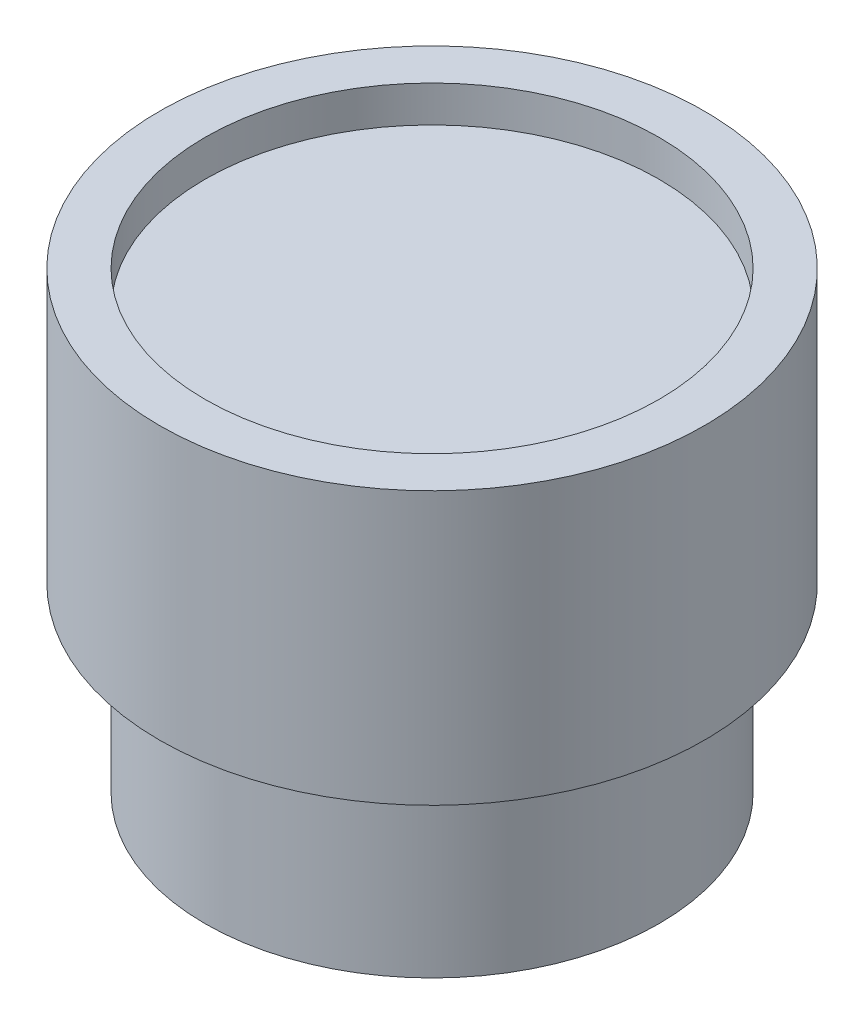
ISO-10303-21;
HEADER;
FILE_DESCRIPTION(('STEP AP214'),'2;1');
FILE_NAME('part.step','',(''),(''),'','','');
FILE_SCHEMA(('AUTOMOTIVE_DESIGN { 1 0 10303 214 1 1 1 1 }'));
ENDSEC;
DATA;
#1=APPLICATION_CONTEXT('core data for automotive mechanical design processes');
#2=APPLICATION_PROTOCOL_DEFINITION('international standard','automotive_design',2000,#1);
#3=PRODUCT_CONTEXT('',#1,'mechanical');
#4=PRODUCT('Part','Part','',(#3));
#5=PRODUCT_RELATED_PRODUCT_CATEGORY('part','',(#4));
#6=PRODUCT_DEFINITION_FORMATION('','',#4);
#7=PRODUCT_DEFINITION_CONTEXT('part definition',#1,'design');
#8=PRODUCT_DEFINITION('design','',#6,#7);
#9=PRODUCT_DEFINITION_SHAPE('','',#8);
#10=(LENGTH_UNIT() NAMED_UNIT(*) SI_UNIT(.MILLI.,.METRE.));
#11=(NAMED_UNIT(*) PLANE_ANGLE_UNIT() SI_UNIT($,.RADIAN.));
#12=(NAMED_UNIT(*) SI_UNIT($,.STERADIAN.) SOLID_ANGLE_UNIT());
#13=UNCERTAINTY_MEASURE_WITH_UNIT(LENGTH_MEASURE(1.E-05),#10,'distance_accuracy_value','');
#14=(GEOMETRIC_REPRESENTATION_CONTEXT(3) GLOBAL_UNCERTAINTY_ASSIGNED_CONTEXT((#13)) GLOBAL_UNIT_ASSIGNED_CONTEXT((#10,
#11,#12)) REPRESENTATION_CONTEXT('',''));
#15=CARTESIAN_POINT('',(0.,0.,0.));
#16=DIRECTION('',(0.,0.,1.));
#17=DIRECTION('',(1.,0.,0.));
#18=AXIS2_PLACEMENT_3D('',#15,#16,#17);
#19=CARTESIAN_POINT('',(0.,10.,0.));
#20=DIRECTION('',(0.,-1.,0.));
#21=DIRECTION('',(0.,0.,-1.));
#22=AXIS2_PLACEMENT_3D('',#19,#20,#21);
#23=CYLINDRICAL_SURFACE('',#22,12.5);
#24=CARTESIAN_POINT('',(0.,10.,0.));
#25=DIRECTION('',(0.,1.,0.));
#26=DIRECTION('',(0.,0.,1.));
#27=AXIS2_PLACEMENT_3D('',#24,#25,#26);
#28=CIRCLE('',#27,12.5);
#29=CARTESIAN_POINT('',(0.,10.,12.5));
#30=VERTEX_POINT('',#29);
#31=EDGE_CURVE('E10',#30,#30,#28,.T.);
#32=ORIENTED_EDGE('',*,*,#31,.F.);
#33=EDGE_LOOP('',(#32));
#34=FACE_BOUND('',#33,.T.);
#35=CARTESIAN_POINT('',(0.,0.,0.));
#36=DIRECTION('',(0.,1.,0.));
#37=DIRECTION('',(0.,0.,1.));
#38=AXIS2_PLACEMENT_3D('',#35,#36,#37);
#39=CIRCLE('',#38,12.5);
#40=CARTESIAN_POINT('',(0.,0.,12.5));
#41=VERTEX_POINT('',#40);
#42=EDGE_CURVE('E33',#41,#41,#39,.T.);
#43=ORIENTED_EDGE('',*,*,#42,.T.);
#44=EDGE_LOOP('',(#43));
#45=FACE_BOUND('',#44,.T.);
#46=ADVANCED_FACE('F30',(#34,#45),#23,.T.);
#47=CARTESIAN_POINT('',(0.,0.,0.));
#48=DIRECTION('',(0.,1.,0.));
#49=DIRECTION('',(0.,0.,1.));
#50=AXIS2_PLACEMENT_3D('',#47,#48,#49);
#51=PLANE('',#50);
#52=ORIENTED_EDGE('',*,*,#42,.F.);
#53=EDGE_LOOP('',(#52));
#54=FACE_BOUND('',#53,.T.);
#55=ADVANCED_FACE('F76',(#54),#51,.F.);
#56=CARTESIAN_POINT('',(0.,10.,0.));
#57=DIRECTION('',(0.,1.,0.));
#58=DIRECTION('',(0.,0.,1.));
#59=AXIS2_PLACEMENT_3D('',#56,#57,#58);
#60=PLANE('',#59);
#61=CARTESIAN_POINT('',(0.,10.,0.));
#62=DIRECTION('',(0.,1.,0.));
#63=DIRECTION('',(0.,0.,1.));
#64=AXIS2_PLACEMENT_3D('',#61,#62,#63);
#65=CIRCLE('',#64,15.);
#66=CARTESIAN_POINT('',(0.,10.,15.));
#67=VERTEX_POINT('',#66);
#68=EDGE_CURVE('E42',#67,#67,#65,.T.);
#69=ORIENTED_EDGE('',*,*,#68,.F.);
#70=EDGE_LOOP('',(#69));
#71=FACE_BOUND('',#70,.T.);
#72=ORIENTED_EDGE('',*,*,#31,.T.);
#73=EDGE_LOOP('',(#72));
#74=FACE_BOUND('',#73,.T.);
#75=ADVANCED_FACE('F71',(#71,#74),#60,.F.);
#76=CARTESIAN_POINT('',(0.,25.,0.));
#77=DIRECTION('',(0.,-1.,0.));
#78=DIRECTION('',(0.,0.,-1.));
#79=AXIS2_PLACEMENT_3D('',#76,#77,#78);
#80=CYLINDRICAL_SURFACE('',#79,15.);
#81=CARTESIAN_POINT('',(0.,25.,0.));
#82=DIRECTION('',(0.,1.,0.));
#83=DIRECTION('',(0.,0.,1.));
#84=AXIS2_PLACEMENT_3D('',#81,#82,#83);
#85=CIRCLE('',#84,15.);
#86=CARTESIAN_POINT('',(0.,25.,15.));
#87=VERTEX_POINT('',#86);
#88=EDGE_CURVE('E40',#87,#87,#85,.T.);
#89=ORIENTED_EDGE('',*,*,#88,.F.);
#90=EDGE_LOOP('',(#89));
#91=FACE_BOUND('',#90,.T.);
#92=ORIENTED_EDGE('',*,*,#68,.T.);
#93=EDGE_LOOP('',(#92));
#94=FACE_BOUND('',#93,.T.);
#95=ADVANCED_FACE('F65',(#91,#94),#80,.T.);
#96=CARTESIAN_POINT('',(0.,25.,0.));
#97=DIRECTION('',(0.,1.,0.));
#98=DIRECTION('',(0.,0.,1.));
#99=AXIS2_PLACEMENT_3D('',#96,#97,#98);
#100=PLANE('',#99);
#101=CARTESIAN_POINT('',(0.,25.,0.));
#102=DIRECTION('',(0.,1.,0.));
#103=DIRECTION('',(0.,0.,1.));
#104=AXIS2_PLACEMENT_3D('',#101,#102,#103);
#105=CIRCLE('',#104,12.5);
#106=CARTESIAN_POINT('',(0.,25.,12.5));
#107=VERTEX_POINT('',#106);
#108=EDGE_CURVE('E48',#107,#107,#105,.T.);
#109=ORIENTED_EDGE('',*,*,#108,.F.);
#110=EDGE_LOOP('',(#109));
#111=FACE_BOUND('',#110,.T.);
#112=ORIENTED_EDGE('',*,*,#88,.T.);
#113=EDGE_LOOP('',(#112));
#114=FACE_BOUND('',#113,.T.);
#115=ADVANCED_FACE('F59',(#111,#114),#100,.T.);
#116=CARTESIAN_POINT('',(0.,23.,0.));
#117=DIRECTION('',(0.,1.,0.));
#118=DIRECTION('',(0.,0.,1.));
#119=AXIS2_PLACEMENT_3D('',#116,#117,#118);
#120=CYLINDRICAL_SURFACE('',#119,12.5);
#121=CARTESIAN_POINT('',(0.,23.,0.));
#122=DIRECTION('',(0.,1.,0.));
#123=DIRECTION('',(0.,0.,1.));
#124=AXIS2_PLACEMENT_3D('',#121,#122,#123);
#125=CIRCLE('',#124,12.5);
#126=CARTESIAN_POINT('',(0.,23.,12.5));
#127=VERTEX_POINT('',#126);
#128=EDGE_CURVE('E45',#127,#127,#125,.T.);
#129=ORIENTED_EDGE('',*,*,#128,.F.);
#130=EDGE_LOOP('',(#129));
#131=FACE_BOUND('',#130,.T.);
#132=ORIENTED_EDGE('',*,*,#108,.T.);
#133=EDGE_LOOP('',(#132));
#134=FACE_BOUND('',#133,.T.);
#135=ADVANCED_FACE('F56',(#131,#134),#120,.F.);
#136=CARTESIAN_POINT('',(0.,23.,0.));
#137=DIRECTION('',(0.,1.,0.));
#138=DIRECTION('',(0.,0.,1.));
#139=AXIS2_PLACEMENT_3D('',#136,#137,#138);
#140=PLANE('',#139);
#141=ORIENTED_EDGE('',*,*,#128,.T.);
#142=EDGE_LOOP('',(#141));
#143=FACE_BOUND('',#142,.T.);
#144=ADVANCED_FACE('F54',(#143),#140,.T.);
#145=CLOSED_SHELL('',(#46,#55,#75,#95,#115,#135,#144));
#146=MANIFOLD_SOLID_BREP('B2',#145);
#147=ADVANCED_BREP_SHAPE_REPRESENTATION('',(#18,#146),#14);
#148=SHAPE_DEFINITION_REPRESENTATION(#9,#147);
ENDSEC;
END-ISO-10303-21;
